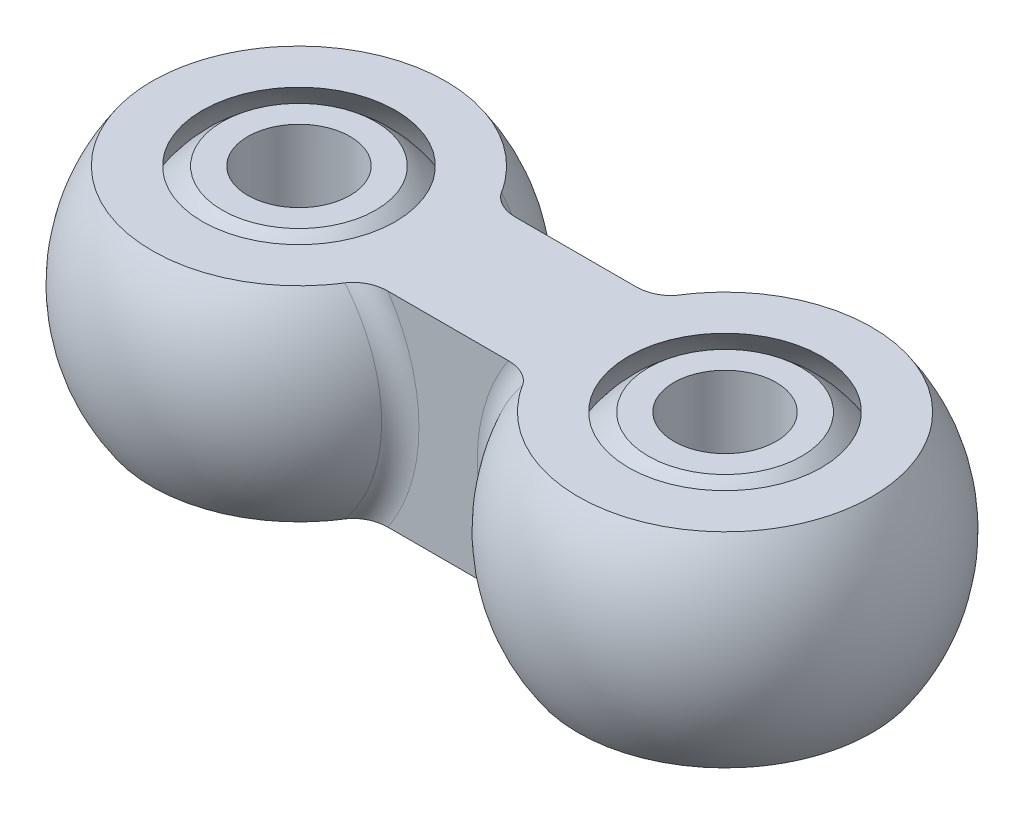
ISO-10303-21;
HEADER;
FILE_DESCRIPTION(('STEP AP214'),'2;1');
FILE_NAME('part.step','',(''),(''),'','','');
FILE_SCHEMA(('AUTOMOTIVE_DESIGN { 1 0 10303 214 1 1 1 1 }'));
ENDSEC;
DATA;
#1=APPLICATION_CONTEXT('core data for automotive mechanical design processes');
#2=APPLICATION_PROTOCOL_DEFINITION('international standard','automotive_design',2000,#1);
#3=PRODUCT_CONTEXT('',#1,'mechanical');
#4=PRODUCT('Part','Part','',(#3));
#5=PRODUCT_RELATED_PRODUCT_CATEGORY('part','',(#4));
#6=PRODUCT_DEFINITION_FORMATION('','',#4);
#7=PRODUCT_DEFINITION_CONTEXT('part definition',#1,'design');
#8=PRODUCT_DEFINITION('design','',#6,#7);
#9=PRODUCT_DEFINITION_SHAPE('','',#8);
#10=(LENGTH_UNIT() NAMED_UNIT(*) SI_UNIT(.MILLI.,.METRE.));
#11=(NAMED_UNIT(*) PLANE_ANGLE_UNIT() SI_UNIT($,.RADIAN.));
#12=(NAMED_UNIT(*) SI_UNIT($,.STERADIAN.) SOLID_ANGLE_UNIT());
#13=UNCERTAINTY_MEASURE_WITH_UNIT(LENGTH_MEASURE(1.E-05),#10,'distance_accuracy_value','');
#14=(GEOMETRIC_REPRESENTATION_CONTEXT(3) GLOBAL_UNCERTAINTY_ASSIGNED_CONTEXT((#13)) GLOBAL_UNIT_ASSIGNED_CONTEXT((#10,
#11,#12)) REPRESENTATION_CONTEXT('',''));
#15=CARTESIAN_POINT('',(0.,0.,0.));
#16=DIRECTION('',(0.,0.,1.));
#17=DIRECTION('',(1.,0.,0.));
#18=AXIS2_PLACEMENT_3D('',#15,#16,#17);
#19=CARTESIAN_POINT('',(8.335,0.,0.));
#20=DIRECTION('',(-1.,0.,0.));
#21=DIRECTION('',(0.,1.,0.));
#22=AXIS2_PLACEMENT_3D('',#19,#20,#21);
#23=SPHERICAL_SURFACE('',#22,5.);
#24=CARTESIAN_POINT('',(8.335,0.,0.));
#25=DIRECTION('',(0.,1.,0.));
#26=DIRECTION('',(-1.,0.,0.));
#27=AXIS2_PLACEMENT_3D('',#24,#25,#26);
#28=SPHERICAL_SURFACE('',#27,5.);
#29=CARTESIAN_POINT('',(8.335,-4.,0.));
#30=DIRECTION('',(0.,1.,0.));
#31=DIRECTION('',(-1.,0.,0.));
#32=AXIS2_PLACEMENT_3D('',#29,#30,#31);
#33=CIRCLE('',#32,3.);
#34=CARTESIAN_POINT('',(5.335,-4.,0.));
#35=VERTEX_POINT('',#34);
#36=EDGE_CURVE('E11',#35,#35,#33,.T.);
#37=ORIENTED_EDGE('',*,*,#36,.T.);
#38=EDGE_LOOP('',(#37));
#39=FACE_BOUND('',#38,.T.);
#40=CARTESIAN_POINT('',(8.335,4.,0.));
#41=DIRECTION('',(0.,-1.,0.));
#42=DIRECTION('',(1.,0.,0.));
#43=AXIS2_PLACEMENT_3D('',#40,#41,#42);
#44=CIRCLE('',#43,3.);
#45=CARTESIAN_POINT('',(11.335,4.,0.));
#46=VERTEX_POINT('',#45);
#47=EDGE_CURVE('E53',#46,#46,#44,.T.);
#48=ORIENTED_EDGE('',*,*,#47,.T.);
#49=EDGE_LOOP('',(#48));
#50=FACE_BOUND('',#49,.T.);
#51=ADVANCED_FACE('F46',(#39,#50),#28,.T.);
#52=CARTESIAN_POINT('',(0.,4.,-10.));
#53=DIRECTION('',(0.,-1.,0.));
#54=DIRECTION('',(1.,0.,0.));
#55=AXIS2_PLACEMENT_3D('',#52,#53,#54);
#56=PLANE('',#55);
#57=CARTESIAN_POINT('',(8.335,4.,0.));
#58=DIRECTION('',(0.,-1.,0.));
#59=DIRECTION('',(1.,0.,0.));
#60=AXIS2_PLACEMENT_3D('',#57,#58,#59);
#61=CIRCLE('',#60,2.);
#62=CARTESIAN_POINT('',(10.335,4.,0.));
#63=VERTEX_POINT('',#62);
#64=EDGE_CURVE('E57',#63,#63,#61,.T.);
#65=ORIENTED_EDGE('',*,*,#64,.T.);
#66=EDGE_LOOP('',(#65));
#67=FACE_BOUND('',#66,.T.);
#68=ORIENTED_EDGE('',*,*,#47,.F.);
#69=EDGE_LOOP('',(#68));
#70=FACE_BOUND('',#69,.T.);
#71=ADVANCED_FACE('F76',(#67,#70),#56,.F.);
#72=CARTESIAN_POINT('',(0.,-4.,-10.));
#73=DIRECTION('',(0.,1.,0.));
#74=DIRECTION('',(-1.,0.,0.));
#75=AXIS2_PLACEMENT_3D('',#72,#73,#74);
#76=PLANE('',#75);
#77=CARTESIAN_POINT('',(8.335,-4.,0.));
#78=DIRECTION('',(0.,1.,0.));
#79=DIRECTION('',(-1.,0.,0.));
#80=AXIS2_PLACEMENT_3D('',#77,#78,#79);
#81=CIRCLE('',#80,2.);
#82=CARTESIAN_POINT('',(6.335,-4.,0.));
#83=VERTEX_POINT('',#82);
#84=EDGE_CURVE('E49',#83,#83,#81,.T.);
#85=ORIENTED_EDGE('',*,*,#84,.T.);
#86=EDGE_LOOP('',(#85));
#87=FACE_BOUND('',#86,.T.);
#88=ORIENTED_EDGE('',*,*,#36,.F.);
#89=EDGE_LOOP('',(#88));
#90=FACE_BOUND('',#89,.T.);
#91=ADVANCED_FACE('F66',(#87,#90),#76,.F.);
#92=CARTESIAN_POINT('',(8.335,-5.,0.));
#93=DIRECTION('',(0.,1.,0.));
#94=DIRECTION('',(0.,0.,1.));
#95=AXIS2_PLACEMENT_3D('',#92,#93,#94);
#96=CYLINDRICAL_SURFACE('',#95,2.);
#97=ORIENTED_EDGE('',*,*,#84,.F.);
#98=EDGE_LOOP('',(#97));
#99=FACE_BOUND('',#98,.T.);
#100=ORIENTED_EDGE('',*,*,#64,.F.);
#101=EDGE_LOOP('',(#100));
#102=FACE_BOUND('',#101,.T.);
#103=ADVANCED_FACE('F69',(#99,#102),#96,.F.);
#104=CLOSED_SHELL('',(#51,#71,#91,#103));
#105=MANIFOLD_SOLID_BREP('B2',#104);
#106=CARTESIAN_POINT('',(-8.335,0.,0.));
#107=DIRECTION('',(-1.,0.,0.));
#108=DIRECTION('',(0.,1.,0.));
#109=AXIS2_PLACEMENT_3D('',#106,#107,#108);
#110=SPHERICAL_SURFACE('',#109,5.);
#111=CARTESIAN_POINT('',(-8.335,0.,0.));
#112=DIRECTION('',(0.,1.,0.));
#113=DIRECTION('',(-1.,0.,0.));
#114=AXIS2_PLACEMENT_3D('',#111,#112,#113);
#115=SPHERICAL_SURFACE('',#114,5.);
#116=CARTESIAN_POINT('',(-8.335,-4.,0.));
#117=DIRECTION('',(0.,1.,0.));
#118=DIRECTION('',(-1.,0.,0.));
#119=AXIS2_PLACEMENT_3D('',#116,#117,#118);
#120=CIRCLE('',#119,3.);
#121=CARTESIAN_POINT('',(-11.335,-4.,0.));
#122=VERTEX_POINT('',#121);
#123=EDGE_CURVE('E45',#122,#122,#120,.T.);
#124=ORIENTED_EDGE('',*,*,#123,.T.);
#125=EDGE_LOOP('',(#124));
#126=FACE_BOUND('',#125,.T.);
#127=CARTESIAN_POINT('',(-8.335,4.,0.));
#128=DIRECTION('',(0.,-1.,0.));
#129=DIRECTION('',(1.,0.,0.));
#130=AXIS2_PLACEMENT_3D('',#127,#128,#129);
#131=CIRCLE('',#130,3.);
#132=CARTESIAN_POINT('',(-5.335,4.,0.));
#133=VERTEX_POINT('',#132);
#134=EDGE_CURVE('E130',#133,#133,#131,.T.);
#135=ORIENTED_EDGE('',*,*,#134,.T.);
#136=EDGE_LOOP('',(#135));
#137=FACE_BOUND('',#136,.T.);
#138=ADVANCED_FACE('F123',(#126,#137),#115,.T.);
#139=CARTESIAN_POINT('',(0.,4.,-10.));
#140=DIRECTION('',(0.,-1.,0.));
#141=DIRECTION('',(1.,0.,0.));
#142=AXIS2_PLACEMENT_3D('',#139,#140,#141);
#143=PLANE('',#142);
#144=CARTESIAN_POINT('',(-8.335,4.,0.));
#145=DIRECTION('',(0.,-1.,0.));
#146=DIRECTION('',(1.,0.,0.));
#147=AXIS2_PLACEMENT_3D('',#144,#145,#146);
#148=CIRCLE('',#147,2.);
#149=CARTESIAN_POINT('',(-6.335,4.,0.));
#150=VERTEX_POINT('',#149);
#151=EDGE_CURVE('E134',#150,#150,#148,.T.);
#152=ORIENTED_EDGE('',*,*,#151,.T.);
#153=EDGE_LOOP('',(#152));
#154=FACE_BOUND('',#153,.T.);
#155=ORIENTED_EDGE('',*,*,#134,.F.);
#156=EDGE_LOOP('',(#155));
#157=FACE_BOUND('',#156,.T.);
#158=ADVANCED_FACE('F153',(#154,#157),#143,.F.);
#159=CARTESIAN_POINT('',(0.,-4.,-10.));
#160=DIRECTION('',(0.,1.,0.));
#161=DIRECTION('',(-1.,0.,0.));
#162=AXIS2_PLACEMENT_3D('',#159,#160,#161);
#163=PLANE('',#162);
#164=CARTESIAN_POINT('',(-8.335,-4.,0.));
#165=DIRECTION('',(0.,1.,0.));
#166=DIRECTION('',(-1.,0.,0.));
#167=AXIS2_PLACEMENT_3D('',#164,#165,#166);
#168=CIRCLE('',#167,2.);
#169=CARTESIAN_POINT('',(-10.335,-4.,0.));
#170=VERTEX_POINT('',#169);
#171=EDGE_CURVE('E126',#170,#170,#168,.T.);
#172=ORIENTED_EDGE('',*,*,#171,.T.);
#173=EDGE_LOOP('',(#172));
#174=FACE_BOUND('',#173,.T.);
#175=ORIENTED_EDGE('',*,*,#123,.F.);
#176=EDGE_LOOP('',(#175));
#177=FACE_BOUND('',#176,.T.);
#178=ADVANCED_FACE('F143',(#174,#177),#163,.F.);
#179=CARTESIAN_POINT('',(-8.335,-5.,0.));
#180=DIRECTION('',(0.,1.,0.));
#181=DIRECTION('',(0.,0.,1.));
#182=AXIS2_PLACEMENT_3D('',#179,#180,#181);
#183=CYLINDRICAL_SURFACE('',#182,2.);
#184=ORIENTED_EDGE('',*,*,#171,.F.);
#185=EDGE_LOOP('',(#184));
#186=FACE_BOUND('',#185,.T.);
#187=ORIENTED_EDGE('',*,*,#151,.F.);
#188=EDGE_LOOP('',(#187));
#189=FACE_BOUND('',#188,.T.);
#190=ADVANCED_FACE('F146',(#186,#189),#183,.F.);
#191=CLOSED_SHELL('',(#138,#158,#178,#190));
#192=MANIFOLD_SOLID_BREP('B6',#191);
#193=CARTESIAN_POINT('',(8.335,0.,0.));
#194=DIRECTION('',(-1.,0.,0.));
#195=DIRECTION('',(0.,1.,0.));
#196=AXIS2_PLACEMENT_3D('',#193,#194,#195);
#197=SPHERICAL_SURFACE('',#196,7.);
#198=CARTESIAN_POINT('',(8.335,-4.,0.));
#199=DIRECTION('',(0.,1.,0.));
#200=DIRECTION('',(-1.,0.,0.));
#201=AXIS2_PLACEMENT_3D('',#198,#199,#200);
#202=CIRCLE('',#201,5.74456264653803);
#203=CARTESIAN_POINT('',(3.47484632444611,-4.,3.0625));
#204=VERTEX_POINT('',#203);
#205=CARTESIAN_POINT('',(3.47484632444611,-4.,-3.0625));
#206=VERTEX_POINT('',#205);
#207=EDGE_CURVE('E274',#204,#206,#202,.T.);
#208=ORIENTED_EDGE('',*,*,#207,.T.);
#209=CARTESIAN_POINT('',(8.335,0.,-3.0625));
#210=DIRECTION('',(0.,0.,1.));
#211=DIRECTION('',(0.,-1.,0.));
#212=AXIS2_PLACEMENT_3D('',#209,#210,#211);
#213=CIRCLE('',#212,6.29452887434794);
#214=CARTESIAN_POINT('',(3.47484632444611,4.,-3.0625));
#215=VERTEX_POINT('',#214);
#216=EDGE_CURVE('E278',#206,#215,#213,.F.);
#217=ORIENTED_EDGE('',*,*,#216,.T.);
#218=CARTESIAN_POINT('',(8.335,4.,0.));
#219=DIRECTION('',(0.,-1.,0.));
#220=DIRECTION('',(1.,0.,0.));
#221=AXIS2_PLACEMENT_3D('',#218,#219,#220);
#222=CIRCLE('',#221,5.74456264653803);
#223=CARTESIAN_POINT('',(3.47484632444611,4.,3.0625));
#224=VERTEX_POINT('',#223);
#225=EDGE_CURVE('E277',#215,#224,#222,.T.);
#226=ORIENTED_EDGE('',*,*,#225,.T.);
#227=CARTESIAN_POINT('',(8.335,0.,3.0625));
#228=DIRECTION('',(0.,0.,-1.));
#229=DIRECTION('',(0.,1.,0.));
#230=AXIS2_PLACEMENT_3D('',#227,#228,#229);
#231=CIRCLE('',#230,6.29452887434794);
#232=EDGE_CURVE('E265',#224,#204,#231,.F.);
#233=ORIENTED_EDGE('',*,*,#232,.T.);
#234=EDGE_LOOP('',(#208,#217,#226,#233));
#235=FACE_BOUND('',#234,.T.);
#236=ADVANCED_FACE('F191',(#235),#197,.T.);
#237=CARTESIAN_POINT('',(8.335,0.,0.));
#238=DIRECTION('',(-1.,0.,0.));
#239=DIRECTION('',(0.,-1.,0.));
#240=AXIS2_PLACEMENT_3D('',#237,#238,#239);
#241=SPHERICAL_SURFACE('',#240,5.5);
#242=CARTESIAN_POINT('',(8.335,0.,0.));
#243=DIRECTION('',(0.,1.,0.));
#244=DIRECTION('',(-1.,0.,0.));
#245=AXIS2_PLACEMENT_3D('',#242,#243,#244);
#246=SPHERICAL_SURFACE('',#245,5.5);
#247=CARTESIAN_POINT('',(8.335,-4.,0.));
#248=DIRECTION('',(0.,1.,0.));
#249=DIRECTION('',(-1.,0.,0.));
#250=AXIS2_PLACEMENT_3D('',#247,#248,#249);
#251=CIRCLE('',#250,3.77491721763537);
#252=CARTESIAN_POINT('',(4.56008278236463,-4.,0.));
#253=VERTEX_POINT('',#252);
#254=EDGE_CURVE('E285',#253,#253,#251,.F.);
#255=ORIENTED_EDGE('',*,*,#254,.T.);
#256=EDGE_LOOP('',(#255));
#257=FACE_BOUND('',#256,.T.);
#258=CARTESIAN_POINT('',(8.335,4.,0.));
#259=DIRECTION('',(0.,-1.,0.));
#260=DIRECTION('',(1.,0.,0.));
#261=AXIS2_PLACEMENT_3D('',#258,#259,#260);
#262=CIRCLE('',#261,3.77491721763537);
#263=CARTESIAN_POINT('',(12.1099172176354,4.,0.));
#264=VERTEX_POINT('',#263);
#265=EDGE_CURVE('E292',#264,#264,#262,.F.);
#266=ORIENTED_EDGE('',*,*,#265,.T.);
#267=EDGE_LOOP('',(#266));
#268=FACE_BOUND('',#267,.T.);
#269=ADVANCED_FACE('F333',(#257,#268),#246,.F.);
#270=CARTESIAN_POINT('',(0.,4.,-10.));
#271=DIRECTION('',(0.,-1.,0.));
#272=DIRECTION('',(1.,0.,0.));
#273=AXIS2_PLACEMENT_3D('',#270,#271,#272);
#274=PLANE('',#273);
#275=ORIENTED_EDGE('',*,*,#265,.F.);
#276=EDGE_LOOP('',(#275));
#277=FACE_BOUND('',#276,.T.);
#278=ORIENTED_EDGE('',*,*,#225,.F.);
#279=CARTESIAN_POINT('',(3.47484632444611,4.,-3.0625));
#280=CARTESIAN_POINT('',(3.44089298216371,4.,-3.00867786002711));
#281=CARTESIAN_POINT('',(3.40172419805761,4.,-2.95849546868459));
#282=CARTESIAN_POINT('',(3.31552938301232,4.,-2.8660397673351));
#283=CARTESIAN_POINT('',(3.26856356415269,4.,-2.82371074304054));
#284=CARTESIAN_POINT('',(3.16905560102687,4.,-2.74700043688414));
#285=CARTESIAN_POINT('',(3.11654572878385,4.,-2.7125765000778));
#286=CARTESIAN_POINT('',(3.00712491200915,4.,-2.65128127613489));
#287=CARTESIAN_POINT('',(2.95020204871326,4.,-2.62443142033111));
#288=CARTESIAN_POINT('',(2.82210111668291,4.,-2.5740173006974));
#289=CARTESIAN_POINT('',(2.7502844677766,4.,-2.55207369014693));
#290=CARTESIAN_POINT('',(2.60428484155405,4.,-2.51934208856279));
#291=CARTESIAN_POINT('',(2.53010664865541,4.,-2.50853285887706));
#292=CARTESIAN_POINT('',(2.42238921311174,4.,-2.50114599046667));
#293=CARTESIAN_POINT('',(2.38912312286677,4.,-2.50000045850501));
#294=CARTESIAN_POINT('',(2.3558696284493,4.,-2.5));
#295=B_SPLINE_CURVE_WITH_KNOTS('',3,(#279,#280,#281,#282,#283,#284,#285,#286,#287,#288,#289,
#290,#291,#292,#293,#294),.UNSPECIFIED.,.F.,.F.,(4,2,2,2,2,2,2,4),(0.,0.190172238413706,
0.378938925090917,0.566661772660793,0.754910584241993,0.979303535063512,1.20326766285938,
1.30304442000673),.UNSPECIFIED.);
#296=CARTESIAN_POINT('',(2.3558696284493,4.,-2.5));
#297=VERTEX_POINT('',#296);
#298=EDGE_CURVE('E309',#215,#297,#295,.T.);
#299=ORIENTED_EDGE('',*,*,#298,.T.);
#300=DIRECTION('',(-1.,0.,0.));
#301=VECTOR('',#300,1.);
#302=CARTESIAN_POINT('',(15.336,4.,-2.5));
#303=LINE('',#302,#301);
#304=CARTESIAN_POINT('',(-2.35586962844929,4.,-2.5));
#305=VERTEX_POINT('',#304);
#306=EDGE_CURVE('E381',#297,#305,#303,.T.);
#307=ORIENTED_EDGE('',*,*,#306,.T.);
#308=CARTESIAN_POINT('',(-2.3558696284493,4.,-2.5));
#309=CARTESIAN_POINT('',(-2.44043521912824,4.,-2.50003553031124));
#310=CARTESIAN_POINT('',(-2.52501199700565,4.,-2.50741540818685));
#311=CARTESIAN_POINT('',(-2.6925612444118,4.,-2.5366666575368));
#312=CARTESIAN_POINT('',(-2.77550658497844,4.,-2.55869341473641));
#313=CARTESIAN_POINT('',(-2.93384592384427,4.,-2.61616049129725));
#314=CARTESIAN_POINT('',(-3.00939103063272,4.,-2.65118300456631));
#315=CARTESIAN_POINT('',(-3.15234645370708,4.,-2.73440702470107));
#316=CARTESIAN_POINT('',(-3.21980843412765,4.,-2.78251760081482));
#317=CARTESIAN_POINT('',(-3.31856306540091,4.,-2.8699859774224));
#318=CARTESIAN_POINT('',(-3.35355379690165,4.,-2.90518785358982));
#319=CARTESIAN_POINT('',(-3.41840996770755,4.,-2.98033818236824));
#320=CARTESIAN_POINT('',(-3.4482473031727,4.,-3.02031076871563));
#321=CARTESIAN_POINT('',(-3.47484632444611,4.,-3.0625));
#322=B_SPLINE_CURVE_WITH_KNOTS('',3,(#308,#309,#310,#311,#312,#313,#314,#315,#316,#317,#318,
#319,#320,#321),.UNSPECIFIED.,.F.,.F.,(4,2,2,2,2,2,4),(0.,0.253421277741336,0.509574879396888,
0.758120828461405,1.00498223221744,1.1534373580971,1.30267813197869),.UNSPECIFIED.);
#323=CARTESIAN_POINT('',(-3.47484632444611,4.,-3.0625));
#324=VERTEX_POINT('',#323);
#325=EDGE_CURVE('E340',#305,#324,#322,.T.);
#326=ORIENTED_EDGE('',*,*,#325,.T.);
#327=CARTESIAN_POINT('',(-8.335,4.,0.));
#328=DIRECTION('',(0.,-1.,0.));
#329=DIRECTION('',(1.,0.,0.));
#330=AXIS2_PLACEMENT_3D('',#327,#328,#329);
#331=CIRCLE('',#330,5.74456264653803);
#332=CARTESIAN_POINT('',(-3.47484632444611,4.,3.0625));
#333=VERTEX_POINT('',#332);
#334=EDGE_CURVE('E397',#333,#324,#331,.T.);
#335=ORIENTED_EDGE('',*,*,#334,.F.);
#336=CARTESIAN_POINT('',(-3.47484632444611,4.,3.0625));
#337=CARTESIAN_POINT('',(-3.44089298216371,4.,3.00867786002711));
#338=CARTESIAN_POINT('',(-3.40172419805761,4.,2.95849546868459));
#339=CARTESIAN_POINT('',(-3.31552938301231,4.,2.8660397673351));
#340=CARTESIAN_POINT('',(-3.26856356415269,4.,2.82371074304054));
#341=CARTESIAN_POINT('',(-3.16905560102687,4.,2.74700043688414));
#342=CARTESIAN_POINT('',(-3.11654572878385,4.,2.7125765000778));
#343=CARTESIAN_POINT('',(-3.00712491200915,4.,2.65128127613489));
#344=CARTESIAN_POINT('',(-2.95020204871326,4.,2.62443142033111));
#345=CARTESIAN_POINT('',(-2.82210111668291,4.,2.5740173006974));
#346=CARTESIAN_POINT('',(-2.7502844677766,4.,2.55207369014693));
#347=CARTESIAN_POINT('',(-2.60428484155405,4.,2.51934208856279));
#348=CARTESIAN_POINT('',(-2.53010664865541,4.,2.50853285887706));
#349=CARTESIAN_POINT('',(-2.42238921311174,4.,2.50114599046667));
#350=CARTESIAN_POINT('',(-2.38912312286677,4.,2.50000045850501));
#351=CARTESIAN_POINT('',(-2.3558696284493,4.,2.5));
#352=B_SPLINE_CURVE_WITH_KNOTS('',3,(#336,#337,#338,#339,#340,#341,#342,#343,#344,#345,#346,
#347,#348,#349,#350,#351),.UNSPECIFIED.,.F.,.F.,(4,2,2,2,2,2,2,4),(0.,0.190172238413706,
0.378938925090917,0.566661772660792,0.754910584241993,0.979303535063513,1.20326766285938,
1.30304442000673),.UNSPECIFIED.);
#353=CARTESIAN_POINT('',(-2.35586962844929,4.,2.5));
#354=VERTEX_POINT('',#353);
#355=EDGE_CURVE('E121',#333,#354,#352,.T.);
#356=ORIENTED_EDGE('',*,*,#355,.T.);
#357=DIRECTION('',(-1.,0.,0.));
#358=VECTOR('',#357,1.);
#359=CARTESIAN_POINT('',(15.336,4.,2.5));
#360=LINE('',#359,#358);
#361=CARTESIAN_POINT('',(2.3558696284493,4.,2.5));
#362=VERTEX_POINT('',#361);
#363=EDGE_CURVE('E376',#362,#354,#360,.T.);
#364=ORIENTED_EDGE('',*,*,#363,.F.);
#365=CARTESIAN_POINT('',(2.3558696284493,4.,2.5));
#366=CARTESIAN_POINT('',(2.44043521912824,4.,2.50003553031124));
#367=CARTESIAN_POINT('',(2.52501199700565,4.,2.50741540818685));
#368=CARTESIAN_POINT('',(2.6925612444118,4.,2.5366666575368));
#369=CARTESIAN_POINT('',(2.77550658497843,4.,2.55869341473641));
#370=CARTESIAN_POINT('',(2.93384592384427,4.,2.61616049129724));
#371=CARTESIAN_POINT('',(3.00939103063272,4.,2.65118300456631));
#372=CARTESIAN_POINT('',(3.15234645370708,4.,2.73440702470107));
#373=CARTESIAN_POINT('',(3.21980843412765,4.,2.78251760081482));
#374=CARTESIAN_POINT('',(3.31856306540091,4.,2.8699859774224));
#375=CARTESIAN_POINT('',(3.35355379690165,4.,2.90518785358982));
#376=CARTESIAN_POINT('',(3.41840996770755,4.,2.98033818236824));
#377=CARTESIAN_POINT('',(3.4482473031727,4.,3.02031076871563));
#378=CARTESIAN_POINT('',(3.47484632444611,4.,3.0625));
#379=B_SPLINE_CURVE_WITH_KNOTS('',3,(#365,#366,#367,#368,#369,#370,#371,#372,#373,#374,#375,
#376,#377,#378),.UNSPECIFIED.,.F.,.F.,(4,2,2,2,2,2,4),(0.,0.253421277741336,0.509574879396887,
0.758120828461406,1.00498223221744,1.15343735809711,1.30267813197869),.UNSPECIFIED.);
#380=EDGE_CURVE('E267',#362,#224,#379,.T.);
#381=ORIENTED_EDGE('',*,*,#380,.T.);
#382=EDGE_LOOP('',(#278,#299,#307,#326,#335,#356,#364,#381));
#383=FACE_BOUND('',#382,.T.);
#384=CARTESIAN_POINT('',(-8.335,4.,0.));
#385=DIRECTION('',(0.,-1.,0.));
#386=DIRECTION('',(1.,0.,0.));
#387=AXIS2_PLACEMENT_3D('',#384,#385,#386);
#388=CIRCLE('',#387,3.77491721763538);
#389=CARTESIAN_POINT('',(-4.56008278236462,4.,0.));
#390=VERTEX_POINT('',#389);
#391=EDGE_CURVE('E403',#390,#390,#388,.F.);
#392=ORIENTED_EDGE('',*,*,#391,.F.);
#393=EDGE_LOOP('',(#392));
#394=FACE_BOUND('',#393,.T.);
#395=ADVANCED_FACE('F322',(#277,#383,#394),#274,.F.);
#396=CARTESIAN_POINT('',(0.,-4.,-10.));
#397=DIRECTION('',(0.,1.,0.));
#398=DIRECTION('',(-1.,0.,0.));
#399=AXIS2_PLACEMENT_3D('',#396,#397,#398);
#400=PLANE('',#399);
#401=ORIENTED_EDGE('',*,*,#254,.F.);
#402=EDGE_LOOP('',(#401));
#403=FACE_BOUND('',#402,.T.);
#404=ORIENTED_EDGE('',*,*,#207,.F.);
#405=CARTESIAN_POINT('',(3.47484632444611,-4.,3.0625));
#406=CARTESIAN_POINT('',(3.44089298216371,-4.,3.0086778600271));
#407=CARTESIAN_POINT('',(3.40172419805761,-4.,2.95849546868459));
#408=CARTESIAN_POINT('',(3.31552938301231,-4.,2.8660397673351));
#409=CARTESIAN_POINT('',(3.26856356415269,-4.,2.82371074304054));
#410=CARTESIAN_POINT('',(3.16905560102687,-4.,2.74700043688414));
#411=CARTESIAN_POINT('',(3.11654572878385,-4.,2.7125765000778));
#412=CARTESIAN_POINT('',(3.00712491200915,-4.,2.65128127613489));
#413=CARTESIAN_POINT('',(2.95020204871326,-4.,2.62443142033111));
#414=CARTESIAN_POINT('',(2.82210111668291,-4.,2.5740173006974));
#415=CARTESIAN_POINT('',(2.7502844677766,-4.,2.55207369014692));
#416=CARTESIAN_POINT('',(2.60428484155405,-4.,2.51934208856279));
#417=CARTESIAN_POINT('',(2.53010664865541,-4.,2.50853285887706));
#418=CARTESIAN_POINT('',(2.42238921311173,-4.,2.50114599046667));
#419=CARTESIAN_POINT('',(2.38912312286677,-4.,2.50000045850501));
#420=CARTESIAN_POINT('',(2.3558696284493,-4.,2.5));
#421=B_SPLINE_CURVE_WITH_KNOTS('',3,(#405,#406,#407,#408,#409,#410,#411,#412,#413,#414,#415,
#416,#417,#418,#419,#420),.UNSPECIFIED.,.F.,.F.,(4,2,2,2,2,2,2,4),(0.,0.190172238413706,
0.378938925090917,0.566661772660793,0.754910584241993,0.979303535063513,1.20326766285938,
1.30304442000673),.UNSPECIFIED.);
#422=CARTESIAN_POINT('',(2.3558696284493,-4.,2.5));
#423=VERTEX_POINT('',#422);
#424=EDGE_CURVE('E219',#204,#423,#421,.T.);
#425=ORIENTED_EDGE('',*,*,#424,.T.);
#426=DIRECTION('',(-1.,0.,0.));
#427=VECTOR('',#426,1.);
#428=CARTESIAN_POINT('',(15.336,-4.,2.5));
#429=LINE('',#428,#427);
#430=CARTESIAN_POINT('',(-2.35586962844929,-4.,2.5));
#431=VERTEX_POINT('',#430);
#432=EDGE_CURVE('E380',#423,#431,#429,.T.);
#433=ORIENTED_EDGE('',*,*,#432,.T.);
#434=CARTESIAN_POINT('',(-2.3558696284493,-4.,2.5));
#435=CARTESIAN_POINT('',(-2.44043521912824,-4.,2.50003553031124));
#436=CARTESIAN_POINT('',(-2.52501199700565,-4.,2.50741540818685));
#437=CARTESIAN_POINT('',(-2.6925612444118,-4.,2.5366666575368));
#438=CARTESIAN_POINT('',(-2.77550658497844,-4.,2.55869341473641));
#439=CARTESIAN_POINT('',(-2.93384592384427,-4.,2.61616049129724));
#440=CARTESIAN_POINT('',(-3.00939103063272,-4.,2.65118300456631));
#441=CARTESIAN_POINT('',(-3.15234645370708,-4.,2.73440702470107));
#442=CARTESIAN_POINT('',(-3.21980843412765,-4.,2.78251760081482));
#443=CARTESIAN_POINT('',(-3.31856306540091,-4.,2.86998597742239));
#444=CARTESIAN_POINT('',(-3.35355379690164,-4.,2.90518785358982));
#445=CARTESIAN_POINT('',(-3.41840996770755,-4.,2.98033818236824));
#446=CARTESIAN_POINT('',(-3.4482473031727,-4.,3.02031076871563));
#447=CARTESIAN_POINT('',(-3.47484632444611,-4.,3.0625));
#448=B_SPLINE_CURVE_WITH_KNOTS('',3,(#434,#435,#436,#437,#438,#439,#440,#441,#442,#443,#444,
#445,#446,#447),.UNSPECIFIED.,.F.,.F.,(4,2,2,2,2,2,4),(0.,0.253421277741336,0.509574879396888,
0.758120828461404,1.00498223221743,1.1534373580971,1.30267813197869),.UNSPECIFIED.);
#449=CARTESIAN_POINT('',(-3.47484632444611,-4.,3.0625));
#450=VERTEX_POINT('',#449);
#451=EDGE_CURVE('E205',#431,#450,#448,.T.);
#452=ORIENTED_EDGE('',*,*,#451,.T.);
#453=CARTESIAN_POINT('',(-8.335,-4.,0.));
#454=DIRECTION('',(0.,1.,0.));
#455=DIRECTION('',(-1.,0.,0.));
#456=AXIS2_PLACEMENT_3D('',#453,#454,#455);
#457=CIRCLE('',#456,5.74456264653803);
#458=CARTESIAN_POINT('',(-3.47484632444611,-4.,-3.0625));
#459=VERTEX_POINT('',#458);
#460=EDGE_CURVE('E385',#459,#450,#457,.T.);
#461=ORIENTED_EDGE('',*,*,#460,.F.);
#462=CARTESIAN_POINT('',(-3.47484632444611,-4.,-3.0625));
#463=CARTESIAN_POINT('',(-3.44089298216371,-4.,-3.0086778600271));
#464=CARTESIAN_POINT('',(-3.40172419805761,-4.,-2.95849546868459));
#465=CARTESIAN_POINT('',(-3.31552938301231,-4.,-2.8660397673351));
#466=CARTESIAN_POINT('',(-3.26856356415269,-4.,-2.82371074304054));
#467=CARTESIAN_POINT('',(-3.16905560102687,-4.,-2.74700043688414));
#468=CARTESIAN_POINT('',(-3.11654572878385,-4.,-2.7125765000778));
#469=CARTESIAN_POINT('',(-3.00712491200915,-4.,-2.65128127613489));
#470=CARTESIAN_POINT('',(-2.95020204871325,-4.,-2.62443142033111));
#471=CARTESIAN_POINT('',(-2.82210111668291,-4.,-2.5740173006974));
#472=CARTESIAN_POINT('',(-2.7502844677766,-4.,-2.55207369014692));
#473=CARTESIAN_POINT('',(-2.60428484155405,-4.,-2.51934208856279));
#474=CARTESIAN_POINT('',(-2.53010664865541,-4.,-2.50853285887706));
#475=CARTESIAN_POINT('',(-2.42238921311174,-4.,-2.50114599046667));
#476=CARTESIAN_POINT('',(-2.38912312286677,-4.,-2.50000045850501));
#477=CARTESIAN_POINT('',(-2.3558696284493,-4.,-2.5));
#478=B_SPLINE_CURVE_WITH_KNOTS('',3,(#462,#463,#464,#465,#466,#467,#468,#469,#470,#471,#472,
#473,#474,#475,#476,#477),.UNSPECIFIED.,.F.,.F.,(4,2,2,2,2,2,2,4),(0.,0.190172238413706,
0.378938925090918,0.566661772660795,0.754910584241994,0.979303535063513,1.20326766285938,
1.30304442000673),.UNSPECIFIED.);
#479=CARTESIAN_POINT('',(-2.35586962844929,-4.,-2.5));
#480=VERTEX_POINT('',#479);
#481=EDGE_CURVE('E268',#459,#480,#478,.T.);
#482=ORIENTED_EDGE('',*,*,#481,.T.);
#483=DIRECTION('',(-1.,0.,0.));
#484=VECTOR('',#483,1.);
#485=CARTESIAN_POINT('',(15.336,-4.,-2.5));
#486=LINE('',#485,#484);
#487=CARTESIAN_POINT('',(2.3558696284493,-4.,-2.5));
#488=VERTEX_POINT('',#487);
#489=EDGE_CURVE('E294',#488,#480,#486,.T.);
#490=ORIENTED_EDGE('',*,*,#489,.F.);
#491=CARTESIAN_POINT('',(2.3558696284493,-4.,-2.5));
#492=CARTESIAN_POINT('',(2.44043521912824,-4.,-2.50003553031124));
#493=CARTESIAN_POINT('',(2.52501199700565,-4.,-2.50741540818685));
#494=CARTESIAN_POINT('',(2.6925612444118,-4.,-2.5366666575368));
#495=CARTESIAN_POINT('',(2.77550658497843,-4.,-2.55869341473641));
#496=CARTESIAN_POINT('',(2.93384592384427,-4.,-2.61616049129724));
#497=CARTESIAN_POINT('',(3.00939103063272,-4.,-2.65118300456631));
#498=CARTESIAN_POINT('',(3.15234645370708,-4.,-2.73440702470106));
#499=CARTESIAN_POINT('',(3.21980843412765,-4.,-2.78251760081482));
#500=CARTESIAN_POINT('',(3.31856306540091,-4.,-2.8699859774224));
#501=CARTESIAN_POINT('',(3.35355379690165,-4.,-2.90518785358982));
#502=CARTESIAN_POINT('',(3.41840996770755,-4.,-2.98033818236824));
#503=CARTESIAN_POINT('',(3.4482473031727,-4.,-3.02031076871563));
#504=CARTESIAN_POINT('',(3.47484632444611,-4.,-3.0625));
#505=B_SPLINE_CURVE_WITH_KNOTS('',3,(#491,#492,#493,#494,#495,#496,#497,#498,#499,#500,#501,
#502,#503,#504),.UNSPECIFIED.,.F.,.F.,(4,2,2,2,2,2,4),(0.,0.253421277741336,0.509574879396888,
0.758120828461405,1.00498223221744,1.1534373580971,1.30267813197869),.UNSPECIFIED.);
#506=EDGE_CURVE('E284',#488,#206,#505,.T.);
#507=ORIENTED_EDGE('',*,*,#506,.T.);
#508=EDGE_LOOP('',(#404,#425,#433,#452,#461,#482,#490,#507));
#509=FACE_BOUND('',#508,.T.);
#510=CARTESIAN_POINT('',(-8.335,-4.,0.));
#511=DIRECTION('',(0.,1.,0.));
#512=DIRECTION('',(-1.,0.,0.));
#513=AXIS2_PLACEMENT_3D('',#510,#511,#512);
#514=CIRCLE('',#513,3.77491721763538);
#515=CARTESIAN_POINT('',(-12.1099172176354,-4.,0.));
#516=VERTEX_POINT('',#515);
#517=EDGE_CURVE('E402',#516,#516,#514,.F.);
#518=ORIENTED_EDGE('',*,*,#517,.F.);
#519=EDGE_LOOP('',(#518));
#520=FACE_BOUND('',#519,.T.);
#521=ADVANCED_FACE('F280',(#403,#509,#520),#400,.F.);
#522=CARTESIAN_POINT('',(15.336,4.,2.5));
#523=DIRECTION('',(0.,0.,-1.));
#524=DIRECTION('',(0.,1.,0.));
#525=AXIS2_PLACEMENT_3D('',#522,#523,#524);
#526=PLANE('',#525);
#527=ORIENTED_EDGE('',*,*,#432,.F.);
#528=CARTESIAN_POINT('',(8.335,0.,2.5));
#529=DIRECTION('',(0.,0.,-1.));
#530=DIRECTION('',(0.,1.,0.));
#531=AXIS2_PLACEMENT_3D('',#528,#529,#530);
#532=CIRCLE('',#531,7.19374728496908);
#533=EDGE_CURVE('E266',#423,#362,#532,.T.);
#534=ORIENTED_EDGE('',*,*,#533,.T.);
#535=ORIENTED_EDGE('',*,*,#363,.T.);
#536=CARTESIAN_POINT('',(-8.335,0.,2.5));
#537=DIRECTION('',(0.,0.,-1.));
#538=DIRECTION('',(0.,1.,0.));
#539=AXIS2_PLACEMENT_3D('',#536,#537,#538);
#540=CIRCLE('',#539,7.19374728496908);
#541=EDGE_CURVE('E306',#354,#431,#540,.T.);
#542=ORIENTED_EDGE('',*,*,#541,.T.);
#543=EDGE_LOOP('',(#527,#534,#535,#542));
#544=FACE_BOUND('',#543,.T.);
#545=ADVANCED_FACE('F358',(#544),#526,.F.);
#546=CARTESIAN_POINT('',(15.336,-4.,-2.5));
#547=DIRECTION('',(0.,0.,1.));
#548=DIRECTION('',(0.,-1.,0.));
#549=AXIS2_PLACEMENT_3D('',#546,#547,#548);
#550=PLANE('',#549);
#551=ORIENTED_EDGE('',*,*,#306,.F.);
#552=CARTESIAN_POINT('',(8.335,0.,-2.5));
#553=DIRECTION('',(0.,0.,1.));
#554=DIRECTION('',(0.,-1.,0.));
#555=AXIS2_PLACEMENT_3D('',#552,#553,#554);
#556=CIRCLE('',#555,7.19374728496908);
#557=EDGE_CURVE('E300',#297,#488,#556,.T.);
#558=ORIENTED_EDGE('',*,*,#557,.T.);
#559=ORIENTED_EDGE('',*,*,#489,.T.);
#560=CARTESIAN_POINT('',(-8.335,0.,-2.5));
#561=DIRECTION('',(0.,0.,1.));
#562=DIRECTION('',(0.,-1.,0.));
#563=AXIS2_PLACEMENT_3D('',#560,#561,#562);
#564=CIRCLE('',#563,7.19374728496908);
#565=EDGE_CURVE('E297',#480,#305,#564,.T.);
#566=ORIENTED_EDGE('',*,*,#565,.T.);
#567=EDGE_LOOP('',(#551,#558,#559,#566));
#568=FACE_BOUND('',#567,.T.);
#569=ADVANCED_FACE('F392',(#568),#550,.F.);
#570=CARTESIAN_POINT('',(-8.335,0.,0.));
#571=DIRECTION('',(-1.,0.,0.));
#572=DIRECTION('',(0.,1.,0.));
#573=AXIS2_PLACEMENT_3D('',#570,#571,#572);
#574=SPHERICAL_SURFACE('',#573,7.);
#575=ORIENTED_EDGE('',*,*,#334,.T.);
#576=CARTESIAN_POINT('',(-8.335,0.,-3.0625));
#577=DIRECTION('',(0.,0.,1.));
#578=DIRECTION('',(0.,-1.,0.));
#579=AXIS2_PLACEMENT_3D('',#576,#577,#578);
#580=CIRCLE('',#579,6.29452887434794);
#581=EDGE_CURVE('E304',#324,#459,#580,.F.);
#582=ORIENTED_EDGE('',*,*,#581,.T.);
#583=ORIENTED_EDGE('',*,*,#460,.T.);
#584=CARTESIAN_POINT('',(-8.335,0.,3.0625));
#585=DIRECTION('',(0.,0.,-1.));
#586=DIRECTION('',(0.,1.,0.));
#587=AXIS2_PLACEMENT_3D('',#584,#585,#586);
#588=CIRCLE('',#587,6.29452887434794);
#589=EDGE_CURVE('E302',#450,#333,#588,.F.);
#590=ORIENTED_EDGE('',*,*,#589,.T.);
#591=EDGE_LOOP('',(#575,#582,#583,#590));
#592=FACE_BOUND('',#591,.T.);
#593=ADVANCED_FACE('F399',(#592),#574,.T.);
#594=CARTESIAN_POINT('',(-8.335,0.,0.));
#595=DIRECTION('',(-1.,0.,0.));
#596=DIRECTION('',(0.,-1.,0.));
#597=AXIS2_PLACEMENT_3D('',#594,#595,#596);
#598=SPHERICAL_SURFACE('',#597,5.5);
#599=CARTESIAN_POINT('',(-8.335,0.,0.));
#600=DIRECTION('',(0.,1.,0.));
#601=DIRECTION('',(-1.,0.,0.));
#602=AXIS2_PLACEMENT_3D('',#599,#600,#601);
#603=SPHERICAL_SURFACE('',#602,5.5);
#604=ORIENTED_EDGE('',*,*,#517,.T.);
#605=EDGE_LOOP('',(#604));
#606=FACE_BOUND('',#605,.T.);
#607=ORIENTED_EDGE('',*,*,#391,.T.);
#608=EDGE_LOOP('',(#607));
#609=FACE_BOUND('',#608,.T.);
#610=ADVANCED_FACE('F331',(#606,#609),#603,.F.);
#611=CARTESIAN_POINT('',(8.335,0.,-3.5));
#612=DIRECTION('',(0.,0.,1.));
#613=DIRECTION('',(0.,-1.,0.));
#614=AXIS2_PLACEMENT_3D('',#611,#612,#613);
#615=TOROIDAL_SURFACE('',#614,7.19374728496908,1.);
#616=ORIENTED_EDGE('',*,*,#506,.F.);
#617=ORIENTED_EDGE('',*,*,#557,.F.);
#618=ORIENTED_EDGE('',*,*,#298,.F.);
#619=ORIENTED_EDGE('',*,*,#216,.F.);
#620=EDGE_LOOP('',(#616,#617,#618,#619));
#621=FACE_BOUND('',#620,.T.);
#622=ADVANCED_FACE('F325',(#621),#615,.F.);
#623=CARTESIAN_POINT('',(-8.335,0.,-3.5));
#624=DIRECTION('',(0.,0.,1.));
#625=DIRECTION('',(0.,-1.,0.));
#626=AXIS2_PLACEMENT_3D('',#623,#624,#625);
#627=TOROIDAL_SURFACE('',#626,7.19374728496908,1.);
#628=ORIENTED_EDGE('',*,*,#481,.F.);
#629=ORIENTED_EDGE('',*,*,#581,.F.);
#630=ORIENTED_EDGE('',*,*,#325,.F.);
#631=ORIENTED_EDGE('',*,*,#565,.F.);
#632=EDGE_LOOP('',(#628,#629,#630,#631));
#633=FACE_BOUND('',#632,.T.);
#634=ADVANCED_FACE('F330',(#633),#627,.F.);
#635=CARTESIAN_POINT('',(8.335,0.,3.5));
#636=DIRECTION('',(0.,0.,-1.));
#637=DIRECTION('',(0.,1.,0.));
#638=AXIS2_PLACEMENT_3D('',#635,#636,#637);
#639=TOROIDAL_SURFACE('',#638,7.19374728496908,1.);
#640=ORIENTED_EDGE('',*,*,#380,.F.);
#641=ORIENTED_EDGE('',*,*,#533,.F.);
#642=ORIENTED_EDGE('',*,*,#424,.F.);
#643=ORIENTED_EDGE('',*,*,#232,.F.);
#644=EDGE_LOOP('',(#640,#641,#642,#643));
#645=FACE_BOUND('',#644,.T.);
#646=ADVANCED_FACE('F264',(#645),#639,.F.);
#647=CARTESIAN_POINT('',(-8.335,0.,3.5));
#648=DIRECTION('',(0.,0.,-1.));
#649=DIRECTION('',(0.,1.,0.));
#650=AXIS2_PLACEMENT_3D('',#647,#648,#649);
#651=TOROIDAL_SURFACE('',#650,7.19374728496908,1.);
#652=ORIENTED_EDGE('',*,*,#355,.F.);
#653=ORIENTED_EDGE('',*,*,#589,.F.);
#654=ORIENTED_EDGE('',*,*,#451,.F.);
#655=ORIENTED_EDGE('',*,*,#541,.F.);
#656=EDGE_LOOP('',(#652,#653,#654,#655));
#657=FACE_BOUND('',#656,.T.);
#658=ADVANCED_FACE('F193',(#657),#651,.F.);
#659=CLOSED_SHELL('',(#236,#269,#395,#521,#545,#569,#593,#610,#622,#634,#646,#658));
#660=MANIFOLD_SOLID_BREP('B40',#659);
#661=ADVANCED_BREP_SHAPE_REPRESENTATION('',(#18,#105,#192,#660),#14);
#662=SHAPE_DEFINITION_REPRESENTATION(#9,#661);
ENDSEC;
END-ISO-10303-21;
